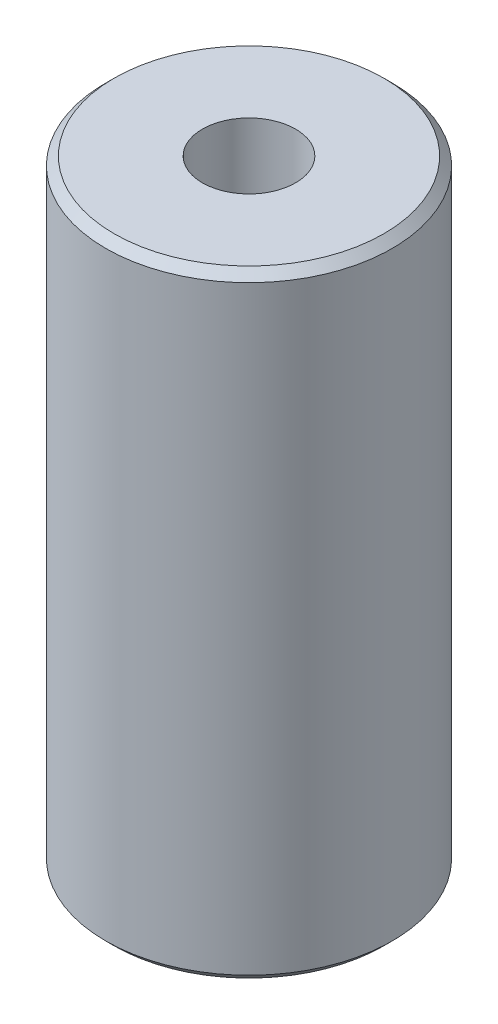
ISO-10303-21;
HEADER;
FILE_DESCRIPTION(('STEP AP214'),'2;1');
FILE_NAME('part.step','',(''),(''),'','','');
FILE_SCHEMA(('AUTOMOTIVE_DESIGN { 1 0 10303 214 1 1 1 1 }'));
ENDSEC;
DATA;
#1=APPLICATION_CONTEXT('core data for automotive mechanical design processes');
#2=APPLICATION_PROTOCOL_DEFINITION('international standard','automotive_design',2000,#1);
#3=PRODUCT_CONTEXT('',#1,'mechanical');
#4=PRODUCT('Part','Part','',(#3));
#5=PRODUCT_RELATED_PRODUCT_CATEGORY('part','',(#4));
#6=PRODUCT_DEFINITION_FORMATION('','',#4);
#7=PRODUCT_DEFINITION_CONTEXT('part definition',#1,'design');
#8=PRODUCT_DEFINITION('design','',#6,#7);
#9=PRODUCT_DEFINITION_SHAPE('','',#8);
#10=(LENGTH_UNIT() NAMED_UNIT(*) SI_UNIT(.MILLI.,.METRE.));
#11=(NAMED_UNIT(*) PLANE_ANGLE_UNIT() SI_UNIT($,.RADIAN.));
#12=(NAMED_UNIT(*) SI_UNIT($,.STERADIAN.) SOLID_ANGLE_UNIT());
#13=UNCERTAINTY_MEASURE_WITH_UNIT(LENGTH_MEASURE(1.E-05),#10,'distance_accuracy_value','');
#14=(GEOMETRIC_REPRESENTATION_CONTEXT(3) GLOBAL_UNCERTAINTY_ASSIGNED_CONTEXT((#13)) GLOBAL_UNIT_ASSIGNED_CONTEXT((#10,
#11,#12)) REPRESENTATION_CONTEXT('',''));
#15=CARTESIAN_POINT('',(0.,0.,0.));
#16=DIRECTION('',(0.,0.,1.));
#17=DIRECTION('',(1.,0.,0.));
#18=AXIS2_PLACEMENT_3D('',#15,#16,#17);
#19=CARTESIAN_POINT('',(0.,258.258872666391,0.));
#20=DIRECTION('',(0.,-1.,0.));
#21=DIRECTION('',(0.,0.,-1.));
#22=AXIS2_PLACEMENT_3D('',#19,#20,#21);
#23=CYLINDRICAL_SURFACE('',#22,60.);
#24=CARTESIAN_POINT('',(0.,254.715733224842,0.));
#25=DIRECTION('',(0.,1.,0.));
#26=DIRECTION('',(0.,0.,1.));
#27=AXIS2_PLACEMENT_3D('',#24,#25,#26);
#28=CIRCLE('',#27,60.);
#29=CARTESIAN_POINT('',(0.,254.715733224842,60.));
#30=VERTEX_POINT('',#29);
#31=EDGE_CURVE('E50',#30,#30,#28,.F.);
#32=ORIENTED_EDGE('',*,*,#31,.T.);
#33=EDGE_LOOP('',(#32));
#34=FACE_BOUND('',#33,.T.);
#35=CARTESIAN_POINT('',(0.,3.54313944154927,0.));
#36=DIRECTION('',(0.,1.,0.));
#37=DIRECTION('',(0.,0.,1.));
#38=AXIS2_PLACEMENT_3D('',#35,#36,#37);
#39=CIRCLE('',#38,60.);
#40=CARTESIAN_POINT('',(0.,3.54313944154927,60.));
#41=VERTEX_POINT('',#40);
#42=EDGE_CURVE('E51',#41,#41,#39,.T.);
#43=ORIENTED_EDGE('',*,*,#42,.T.);
#44=EDGE_LOOP('',(#43));
#45=FACE_BOUND('',#44,.T.);
#46=ADVANCED_FACE('F39',(#34,#45),#23,.T.);
#47=CARTESIAN_POINT('',(0.,258.258872666391,0.));
#48=DIRECTION('',(0.,1.,0.));
#49=DIRECTION('',(0.,0.,1.));
#50=AXIS2_PLACEMENT_3D('',#47,#48,#49);
#51=PLANE('',#50);
#52=CARTESIAN_POINT('',(0.,258.258872666391,0.));
#53=DIRECTION('',(0.,1.,0.));
#54=DIRECTION('',(0.,0.,1.));
#55=AXIS2_PLACEMENT_3D('',#52,#53,#54);
#56=CIRCLE('',#55,56.4568605584507);
#57=CARTESIAN_POINT('',(0.,258.258872666391,56.4568605584507));
#58=VERTEX_POINT('',#57);
#59=EDGE_CURVE('E54',#58,#58,#56,.T.);
#60=ORIENTED_EDGE('',*,*,#59,.T.);
#61=EDGE_LOOP('',(#60));
#62=FACE_BOUND('',#61,.T.);
#63=CARTESIAN_POINT('',(0.,258.258872666391,0.));
#64=DIRECTION('',(0.,1.,0.));
#65=DIRECTION('',(0.,0.,1.));
#66=AXIS2_PLACEMENT_3D('',#63,#64,#65);
#67=CIRCLE('',#66,19.5125229417171);
#68=CARTESIAN_POINT('',(0.,258.258872666391,19.5125229417171));
#69=VERTEX_POINT('',#68);
#70=EDGE_CURVE('E58',#69,#69,#67,.T.);
#71=ORIENTED_EDGE('',*,*,#70,.F.);
#72=EDGE_LOOP('',(#71));
#73=FACE_BOUND('',#72,.T.);
#74=ADVANCED_FACE('F69',(#62,#73),#51,.T.);
#75=CARTESIAN_POINT('',(0.,0.,0.));
#76=DIRECTION('',(0.,1.,0.));
#77=DIRECTION('',(0.,0.,1.));
#78=AXIS2_PLACEMENT_3D('',#75,#76,#77);
#79=PLANE('',#78);
#80=CARTESIAN_POINT('',(0.,0.,0.));
#81=DIRECTION('',(0.,1.,0.));
#82=DIRECTION('',(0.,0.,1.));
#83=AXIS2_PLACEMENT_3D('',#80,#81,#82);
#84=CIRCLE('',#83,56.4568605584507);
#85=CARTESIAN_POINT('',(0.,0.,56.4568605584507));
#86=VERTEX_POINT('',#85);
#87=EDGE_CURVE('E10',#86,#86,#84,.F.);
#88=ORIENTED_EDGE('',*,*,#87,.T.);
#89=EDGE_LOOP('',(#88));
#90=FACE_BOUND('',#89,.T.);
#91=CARTESIAN_POINT('',(0.,0.,0.));
#92=DIRECTION('',(0.,1.,0.));
#93=DIRECTION('',(0.,0.,1.));
#94=AXIS2_PLACEMENT_3D('',#91,#92,#93);
#95=CIRCLE('',#94,19.5125229417171);
#96=CARTESIAN_POINT('',(0.,0.,19.5125229417171));
#97=VERTEX_POINT('',#96);
#98=EDGE_CURVE('E63',#97,#97,#95,.T.);
#99=ORIENTED_EDGE('',*,*,#98,.T.);
#100=EDGE_LOOP('',(#99));
#101=FACE_BOUND('',#100,.T.);
#102=ADVANCED_FACE('F75',(#90,#101),#79,.F.);
#103=CARTESIAN_POINT('',(0.,258.258872666391,0.));
#104=DIRECTION('',(0.,-1.,0.));
#105=DIRECTION('',(0.,0.,-1.));
#106=AXIS2_PLACEMENT_3D('',#103,#104,#105);
#107=CYLINDRICAL_SURFACE('',#106,19.5125229417171);
#108=ORIENTED_EDGE('',*,*,#70,.T.);
#109=EDGE_LOOP('',(#108));
#110=FACE_BOUND('',#109,.T.);
#111=ORIENTED_EDGE('',*,*,#98,.F.);
#112=EDGE_LOOP('',(#111));
#113=FACE_BOUND('',#112,.T.);
#114=ADVANCED_FACE('F70',(#110,#113),#107,.F.);
#115=CARTESIAN_POINT('',(0.,258.258872666391,0.));
#116=DIRECTION('',(0.,-1.,0.));
#117=DIRECTION('',(0.,0.,-1.));
#118=AXIS2_PLACEMENT_3D('',#115,#116,#117);
#119=CONICAL_SURFACE('',#118,56.4568605584507,0.785398163397452);
#120=ORIENTED_EDGE('',*,*,#31,.F.);
#121=EDGE_LOOP('',(#120));
#122=FACE_BOUND('',#121,.T.);
#123=ORIENTED_EDGE('',*,*,#59,.F.);
#124=EDGE_LOOP('',(#123));
#125=FACE_BOUND('',#124,.T.);
#126=ADVANCED_FACE('F81',(#122,#125),#119,.T.);
#127=CARTESIAN_POINT('',(0.,3.54313944154927,0.));
#128=DIRECTION('',(0.,1.,0.));
#129=DIRECTION('',(0.,0.,1.));
#130=AXIS2_PLACEMENT_3D('',#127,#128,#129);
#131=CONICAL_SURFACE('',#130,60.,0.785398163397448);
#132=ORIENTED_EDGE('',*,*,#87,.F.);
#133=EDGE_LOOP('',(#132));
#134=FACE_BOUND('',#133,.T.);
#135=ORIENTED_EDGE('',*,*,#42,.F.);
#136=EDGE_LOOP('',(#135));
#137=FACE_BOUND('',#136,.T.);
#138=ADVANCED_FACE('F45',(#134,#137),#131,.T.);
#139=CLOSED_SHELL('',(#46,#74,#102,#114,#126,#138));
#140=MANIFOLD_SOLID_BREP('B2',#139);
#141=ADVANCED_BREP_SHAPE_REPRESENTATION('',(#18,#140),#14);
#142=SHAPE_DEFINITION_REPRESENTATION(#9,#141);
ENDSEC;
END-ISO-10303-21;
